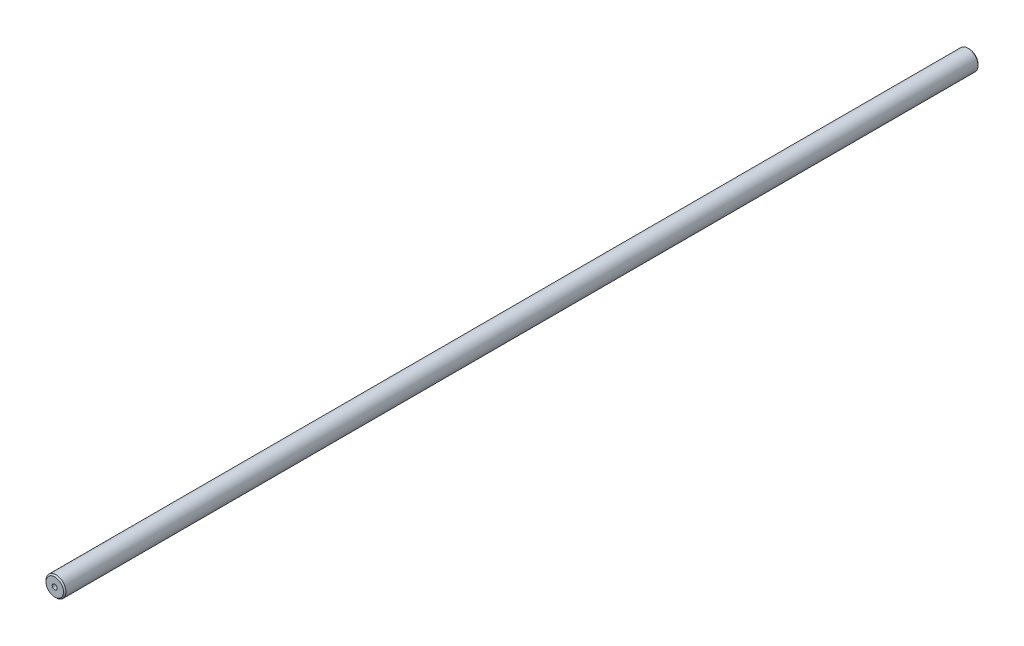
ISO-10303-21;
HEADER;
FILE_DESCRIPTION(('STEP AP214'),'2;1');
FILE_NAME('part.step','',(''),(''),'','','');
FILE_SCHEMA(('AUTOMOTIVE_DESIGN { 1 0 10303 214 1 1 1 1 }'));
ENDSEC;
DATA;
#1=APPLICATION_CONTEXT('core data for automotive mechanical design processes');
#2=APPLICATION_PROTOCOL_DEFINITION('international standard','automotive_design',2000,#1);
#3=PRODUCT_CONTEXT('',#1,'mechanical');
#4=PRODUCT('Part','Part','',(#3));
#5=PRODUCT_RELATED_PRODUCT_CATEGORY('part','',(#4));
#6=PRODUCT_DEFINITION_FORMATION('','',#4);
#7=PRODUCT_DEFINITION_CONTEXT('part definition',#1,'design');
#8=PRODUCT_DEFINITION('design','',#6,#7);
#9=PRODUCT_DEFINITION_SHAPE('','',#8);
#10=(LENGTH_UNIT() NAMED_UNIT(*) SI_UNIT(.MILLI.,.METRE.));
#11=(NAMED_UNIT(*) PLANE_ANGLE_UNIT() SI_UNIT($,.RADIAN.));
#12=(NAMED_UNIT(*) SI_UNIT($,.STERADIAN.) SOLID_ANGLE_UNIT());
#13=UNCERTAINTY_MEASURE_WITH_UNIT(LENGTH_MEASURE(1.E-05),#10,'distance_accuracy_value','');
#14=(GEOMETRIC_REPRESENTATION_CONTEXT(3) GLOBAL_UNCERTAINTY_ASSIGNED_CONTEXT((#13)) GLOBAL_UNIT_ASSIGNED_CONTEXT((#10,
#11,#12)) REPRESENTATION_CONTEXT('',''));
#15=CARTESIAN_POINT('',(0.,0.,0.));
#16=DIRECTION('',(0.,0.,1.));
#17=DIRECTION('',(1.,0.,0.));
#18=AXIS2_PLACEMENT_3D('',#15,#16,#17);
#19=CARTESIAN_POINT('',(0.,0.,366.));
#20=DIRECTION('',(0.,0.,-1.));
#21=DIRECTION('',(-1.,0.,0.));
#22=AXIS2_PLACEMENT_3D('',#19,#20,#21);
#23=CYLINDRICAL_SURFACE('',#22,4.);
#24=CARTESIAN_POINT('',(0.,0.,0.5));
#25=DIRECTION('',(0.,0.,1.));
#26=DIRECTION('',(1.,0.,0.));
#27=AXIS2_PLACEMENT_3D('',#24,#25,#26);
#28=CIRCLE('',#27,4.);
#29=CARTESIAN_POINT('',(4.,0.,0.5));
#30=VERTEX_POINT('',#29);
#31=EDGE_CURVE('E42',#30,#30,#28,.T.);
#32=ORIENTED_EDGE('',*,*,#31,.T.);
#33=EDGE_LOOP('',(#32));
#34=FACE_BOUND('',#33,.T.);
#35=CARTESIAN_POINT('',(0.,0.,365.5));
#36=DIRECTION('',(0.,0.,1.));
#37=DIRECTION('',(1.,0.,0.));
#38=AXIS2_PLACEMENT_3D('',#35,#36,#37);
#39=CIRCLE('',#38,4.);
#40=CARTESIAN_POINT('',(4.,0.,365.5));
#41=VERTEX_POINT('',#40);
#42=EDGE_CURVE('E46',#41,#41,#39,.F.);
#43=ORIENTED_EDGE('',*,*,#42,.T.);
#44=EDGE_LOOP('',(#43));
#45=FACE_BOUND('',#44,.T.);
#46=ADVANCED_FACE('F31',(#34,#45),#23,.T.);
#47=CARTESIAN_POINT('',(0.,0.,366.));
#48=DIRECTION('',(0.,0.,1.));
#49=DIRECTION('',(1.,0.,0.));
#50=AXIS2_PLACEMENT_3D('',#47,#48,#49);
#51=PLANE('',#50);
#52=CARTESIAN_POINT('',(0.,0.,366.));
#53=DIRECTION('',(0.,0.,1.));
#54=DIRECTION('',(1.,0.,0.));
#55=AXIS2_PLACEMENT_3D('',#52,#53,#54);
#56=CIRCLE('',#55,3.49999999999995);
#57=CARTESIAN_POINT('',(3.49999999999995,0.,366.));
#58=VERTEX_POINT('',#57);
#59=EDGE_CURVE('E10',#58,#58,#56,.T.);
#60=ORIENTED_EDGE('',*,*,#59,.T.);
#61=EDGE_LOOP('',(#60));
#62=FACE_BOUND('',#61,.T.);
#63=CARTESIAN_POINT('',(0.,0.,366.));
#64=DIRECTION('',(0.,0.,1.));
#65=DIRECTION('',(1.,0.,0.));
#66=AXIS2_PLACEMENT_3D('',#63,#64,#65);
#67=CIRCLE('',#66,1.);
#68=CARTESIAN_POINT('',(1.,0.,366.));
#69=VERTEX_POINT('',#68);
#70=EDGE_CURVE('E52',#69,#69,#67,.T.);
#71=ORIENTED_EDGE('',*,*,#70,.F.);
#72=EDGE_LOOP('',(#71));
#73=FACE_BOUND('',#72,.T.);
#74=ADVANCED_FACE('F67',(#62,#73),#51,.T.);
#75=CARTESIAN_POINT('',(0.,0.,0.));
#76=DIRECTION('',(0.,0.,1.));
#77=DIRECTION('',(1.,0.,0.));
#78=AXIS2_PLACEMENT_3D('',#75,#76,#77);
#79=PLANE('',#78);
#80=CARTESIAN_POINT('',(0.,0.,0.));
#81=DIRECTION('',(0.,0.,1.));
#82=DIRECTION('',(1.,0.,0.));
#83=AXIS2_PLACEMENT_3D('',#80,#81,#82);
#84=CIRCLE('',#83,3.5);
#85=CARTESIAN_POINT('',(3.5,0.,0.));
#86=VERTEX_POINT('',#85);
#87=EDGE_CURVE('E38',#86,#86,#84,.F.);
#88=ORIENTED_EDGE('',*,*,#87,.T.);
#89=EDGE_LOOP('',(#88));
#90=FACE_BOUND('',#89,.T.);
#91=ADVANCED_FACE('F63',(#90),#79,.F.);
#92=CARTESIAN_POINT('',(0.,0.,356.));
#93=DIRECTION('',(0.,0.,1.));
#94=DIRECTION('',(1.,0.,0.));
#95=AXIS2_PLACEMENT_3D('',#92,#93,#94);
#96=CYLINDRICAL_SURFACE('',#95,1.);
#97=CARTESIAN_POINT('',(0.,0.,356.));
#98=DIRECTION('',(0.,0.,1.));
#99=DIRECTION('',(1.,0.,0.));
#100=AXIS2_PLACEMENT_3D('',#97,#98,#99);
#101=CIRCLE('',#100,1.);
#102=CARTESIAN_POINT('',(1.,0.,356.));
#103=VERTEX_POINT('',#102);
#104=EDGE_CURVE('E51',#103,#103,#101,.T.);
#105=ORIENTED_EDGE('',*,*,#104,.F.);
#106=EDGE_LOOP('',(#105));
#107=FACE_BOUND('',#106,.T.);
#108=ORIENTED_EDGE('',*,*,#70,.T.);
#109=EDGE_LOOP('',(#108));
#110=FACE_BOUND('',#109,.T.);
#111=ADVANCED_FACE('F60',(#107,#110),#96,.F.);
#112=CARTESIAN_POINT('',(0.,0.,356.));
#113=DIRECTION('',(0.,0.,1.));
#114=DIRECTION('',(1.,0.,0.));
#115=AXIS2_PLACEMENT_3D('',#112,#113,#114);
#116=PLANE('',#115);
#117=ORIENTED_EDGE('',*,*,#104,.T.);
#118=EDGE_LOOP('',(#117));
#119=FACE_BOUND('',#118,.T.);
#120=ADVANCED_FACE('F58',(#119),#116,.T.);
#121=CARTESIAN_POINT('',(0.,0.,0.5));
#122=DIRECTION('',(0.,0.,1.));
#123=DIRECTION('',(1.,0.,0.));
#124=AXIS2_PLACEMENT_3D('',#121,#122,#123);
#125=CONICAL_SURFACE('',#124,4.,0.785398163397445);
#126=ORIENTED_EDGE('',*,*,#87,.F.);
#127=EDGE_LOOP('',(#126));
#128=FACE_BOUND('',#127,.T.);
#129=ORIENTED_EDGE('',*,*,#31,.F.);
#130=EDGE_LOOP('',(#129));
#131=FACE_BOUND('',#130,.T.);
#132=ADVANCED_FACE('F78',(#128,#131),#125,.T.);
#133=CARTESIAN_POINT('',(0.,0.,366.));
#134=DIRECTION('',(0.,0.,-1.));
#135=DIRECTION('',(-1.,0.,0.));
#136=AXIS2_PLACEMENT_3D('',#133,#134,#135);
#137=CONICAL_SURFACE('',#136,3.49999999999995,0.785398163397445);
#138=ORIENTED_EDGE('',*,*,#42,.F.);
#139=EDGE_LOOP('',(#138));
#140=FACE_BOUND('',#139,.T.);
#141=ORIENTED_EDGE('',*,*,#59,.F.);
#142=EDGE_LOOP('',(#141));
#143=FACE_BOUND('',#142,.T.);
#144=ADVANCED_FACE('F33',(#140,#143),#137,.T.);
#145=CLOSED_SHELL('',(#46,#74,#91,#111,#120,#132,#144));
#146=MANIFOLD_SOLID_BREP('B2',#145);
#147=ADVANCED_BREP_SHAPE_REPRESENTATION('',(#18,#146),#14);
#148=SHAPE_DEFINITION_REPRESENTATION(#9,#147);
ENDSEC;
END-ISO-10303-21;
